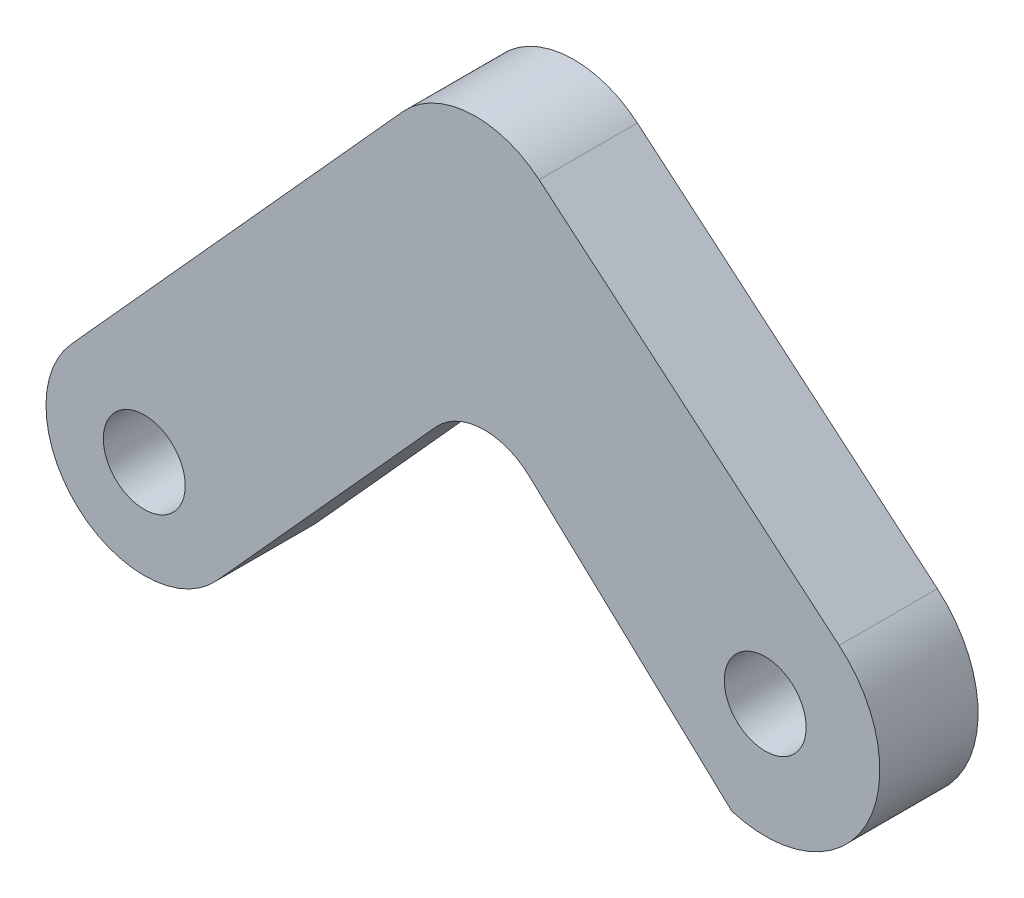
ISO-10303-21;
HEADER;
FILE_DESCRIPTION(('STEP AP214'),'2;1');
FILE_NAME('part.step','',(''),(''),'','','');
FILE_SCHEMA(('AUTOMOTIVE_DESIGN { 1 0 10303 214 1 1 1 1 }'));
ENDSEC;
DATA;
#1=APPLICATION_CONTEXT('core data for automotive mechanical design processes');
#2=APPLICATION_PROTOCOL_DEFINITION('international standard','automotive_design',2000,#1);
#3=PRODUCT_CONTEXT('',#1,'mechanical');
#4=PRODUCT('Part','Part','',(#3));
#5=PRODUCT_RELATED_PRODUCT_CATEGORY('part','',(#4));
#6=PRODUCT_DEFINITION_FORMATION('','',#4);
#7=PRODUCT_DEFINITION_CONTEXT('part definition',#1,'design');
#8=PRODUCT_DEFINITION('design','',#6,#7);
#9=PRODUCT_DEFINITION_SHAPE('','',#8);
#10=(LENGTH_UNIT() NAMED_UNIT(*) SI_UNIT(.MILLI.,.METRE.));
#11=(NAMED_UNIT(*) PLANE_ANGLE_UNIT() SI_UNIT($,.RADIAN.));
#12=(NAMED_UNIT(*) SI_UNIT($,.STERADIAN.) SOLID_ANGLE_UNIT());
#13=UNCERTAINTY_MEASURE_WITH_UNIT(LENGTH_MEASURE(1.E-05),#10,'distance_accuracy_value','');
#14=(GEOMETRIC_REPRESENTATION_CONTEXT(3) GLOBAL_UNCERTAINTY_ASSIGNED_CONTEXT((#13)) GLOBAL_UNIT_ASSIGNED_CONTEXT((#10,
#11,#12)) REPRESENTATION_CONTEXT('',''));
#15=CARTESIAN_POINT('',(0.,0.,0.));
#16=DIRECTION('',(0.,0.,1.));
#17=DIRECTION('',(1.,0.,0.));
#18=AXIS2_PLACEMENT_3D('',#15,#16,#17);
#19=CARTESIAN_POINT('',(8.90555354627744,-8.04307876589465,3.));
#20=DIRECTION('',(0.,0.,1.));
#21=DIRECTION('',(1.,0.,0.));
#22=AXIS2_PLACEMENT_3D('',#19,#20,#21);
#23=PLANE('',#22);
#24=CARTESIAN_POINT('',(8.90555354627744,-8.04307876589465,3.));
#25=DIRECTION('',(0.,0.,1.));
#26=DIRECTION('',(1.,0.,0.));
#27=AXIS2_PLACEMENT_3D('',#24,#25,#26);
#28=CIRCLE('',#27,1.25);
#29=CARTESIAN_POINT('',(10.1555535462774,-8.04307876589465,3.));
#30=VERTEX_POINT('',#29);
#31=EDGE_CURVE('E136',#30,#30,#28,.T.);
#32=ORIENTED_EDGE('',*,*,#31,.F.);
#33=EDGE_LOOP('',(#32));
#34=FACE_BOUND('',#33,.T.);
#35=DIRECTION('',(-0.764131159570834,0.64506090485545,0.));
#36=VECTOR('',#35,1.);
#37=CARTESIAN_POINT('',(-0.215618695095688,4.23715807804301,3.));
#38=LINE('',#37,#36);
#39=CARTESIAN_POINT('',(11.1632667132715,-5.36861970739673,3.));
#40=VERTEX_POINT('',#39);
#41=CARTESIAN_POINT('',(2.00134544875507,2.36565096993392,3.));
#42=VERTEX_POINT('',#41);
#43=EDGE_CURVE('E109',#40,#42,#38,.T.);
#44=ORIENTED_EDGE('',*,*,#43,.T.);
#45=CARTESIAN_POINT('',(0.0661627341887162,0.0732574912214218,3.));
#46=DIRECTION('',(0.,0.,1.));
#47=DIRECTION('',(1.,0.,0.));
#48=AXIS2_PLACEMENT_3D('',#45,#46,#47);
#49=CIRCLE('',#48,3.);
#50=CARTESIAN_POINT('',(-2.16022565238064,2.08402718269509,3.));
#51=VERTEX_POINT('',#50);
#52=EDGE_CURVE('E105',#42,#51,#49,.T.);
#53=ORIENTED_EDGE('',*,*,#52,.T.);
#54=DIRECTION('',(-0.670256563824557,-0.742129462189784,0.));
#55=VECTOR('',#54,1.);
#56=CARTESIAN_POINT('',(-0.215618695095688,4.23715807804301,3.));
#57=LINE('',#56,#55);
#58=CARTESIAN_POINT('',(-12.2802368439377,-9.12117224137309,3.));
#59=VERTEX_POINT('',#58);
#60=EDGE_CURVE('E97',#51,#59,#57,.T.);
#61=ORIENTED_EDGE('',*,*,#60,.T.);
#62=CARTESIAN_POINT('',(-10.0538484573684,-11.1319419328468,3.));
#63=DIRECTION('',(0.,0.,1.));
#64=DIRECTION('',(1.,0.,0.));
#65=AXIS2_PLACEMENT_3D('',#62,#63,#64);
#66=CIRCLE('',#65,3.);
#67=CARTESIAN_POINT('',(-7.827460070799,-13.1427116243204,3.));
#68=VERTEX_POINT('',#67);
#69=EDGE_CURVE('E102',#59,#68,#66,.T.);
#70=ORIENTED_EDGE('',*,*,#69,.T.);
#71=DIRECTION('',(0.670256563824557,0.742129462189784,0.));
#72=VECTOR('',#71,1.);
#73=CARTESIAN_POINT('',(0.215618695095688,-4.23715807804301,3.));
#74=LINE('',#73,#72);
#75=CARTESIAN_POINT('',(-1.14658156815648,-5.74542969121998,3.));
#76=VERTEX_POINT('',#75);
#77=EDGE_CURVE('E123',#68,#76,#74,.T.);
#78=ORIENTED_EDGE('',*,*,#77,.T.);
#79=CARTESIAN_POINT('',(0.337677356223085,-7.0859428188691,3.));
#80=DIRECTION('',(0.,0.,1.));
#81=DIRECTION('',(1.,0.,0.));
#82=AXIS2_PLACEMENT_3D('',#79,#80,#81);
#83=CIRCLE('',#82,2.);
#84=CARTESIAN_POINT('',(1.70183634163487,-5.62338674728747,3.));
#85=VERTEX_POINT('',#84);
#86=EDGE_CURVE('E11',#76,#85,#83,.F.);
#87=ORIENTED_EDGE('',*,*,#86,.T.);
#88=DIRECTION('',(0.731278035790812,-0.682079492705895,0.));
#89=VECTOR('',#88,1.);
#90=CARTESIAN_POINT('',(0.215618695095688,-4.23715807804301,3.));
#91=LINE('',#90,#89);
#92=CARTESIAN_POINT('',(7.88567103741643,-11.391188630896,3.));
#93=VERTEX_POINT('',#92);
#94=EDGE_CURVE('E125',#85,#93,#91,.T.);
#95=ORIENTED_EDGE('',*,*,#94,.T.);
#96=CARTESIAN_POINT('',(8.90555354627744,-8.04307876589465,3.));
#97=DIRECTION('',(0.,0.,1.));
#98=DIRECTION('',(1.,0.,0.));
#99=AXIS2_PLACEMENT_3D('',#96,#97,#98);
#100=CIRCLE('',#99,3.5);
#101=EDGE_CURVE('E130',#93,#40,#100,.T.);
#102=ORIENTED_EDGE('',*,*,#101,.T.);
#103=EDGE_LOOP('',(#44,#53,#61,#70,#78,#87,#95,#102));
#104=FACE_BOUND('',#103,.T.);
#105=CARTESIAN_POINT('',(-10.0538484573684,-11.1319419328468,3.));
#106=DIRECTION('',(0.,0.,1.));
#107=DIRECTION('',(1.,0.,0.));
#108=AXIS2_PLACEMENT_3D('',#105,#106,#107);
#109=CIRCLE('',#108,1.25);
#110=CARTESIAN_POINT('',(-8.80384845736835,-11.1319419328468,3.));
#111=VERTEX_POINT('',#110);
#112=EDGE_CURVE('E184',#111,#111,#109,.T.);
#113=ORIENTED_EDGE('',*,*,#112,.F.);
#114=EDGE_LOOP('',(#113));
#115=FACE_BOUND('',#114,.T.);
#116=ADVANCED_FACE('F33',(#34,#104,#115),#23,.T.);
#117=CARTESIAN_POINT('',(8.90555354627744,-8.04307876589465,0.));
#118=DIRECTION('',(0.,0.,1.));
#119=DIRECTION('',(1.,0.,0.));
#120=AXIS2_PLACEMENT_3D('',#117,#118,#119);
#121=PLANE('',#120);
#122=CARTESIAN_POINT('',(8.90555354627744,-8.04307876589465,0.));
#123=DIRECTION('',(0.,0.,1.));
#124=DIRECTION('',(1.,0.,0.));
#125=AXIS2_PLACEMENT_3D('',#122,#123,#124);
#126=CIRCLE('',#125,1.25);
#127=CARTESIAN_POINT('',(10.1555535462774,-8.04307876589465,0.));
#128=VERTEX_POINT('',#127);
#129=EDGE_CURVE('E181',#128,#128,#126,.T.);
#130=ORIENTED_EDGE('',*,*,#129,.T.);
#131=EDGE_LOOP('',(#130));
#132=FACE_BOUND('',#131,.T.);
#133=DIRECTION('',(-0.670256563824557,-0.742129462189784,0.));
#134=VECTOR('',#133,1.);
#135=CARTESIAN_POINT('',(-0.215618695095688,4.23715807804301,0.));
#136=LINE('',#135,#134);
#137=CARTESIAN_POINT('',(-2.16022565238064,2.08402718269509,0.));
#138=VERTEX_POINT('',#137);
#139=CARTESIAN_POINT('',(-12.2802368439377,-9.12117224137309,0.));
#140=VERTEX_POINT('',#139);
#141=EDGE_CURVE('E115',#138,#140,#136,.T.);
#142=ORIENTED_EDGE('',*,*,#141,.F.);
#143=CARTESIAN_POINT('',(0.0661627341887162,0.0732574912214218,0.));
#144=DIRECTION('',(0.,0.,1.));
#145=DIRECTION('',(1.,0.,0.));
#146=AXIS2_PLACEMENT_3D('',#143,#144,#145);
#147=CIRCLE('',#146,3.);
#148=CARTESIAN_POINT('',(2.00134544875507,2.36565096993392,0.));
#149=VERTEX_POINT('',#148);
#150=EDGE_CURVE('E153',#138,#149,#147,.F.);
#151=ORIENTED_EDGE('',*,*,#150,.T.);
#152=DIRECTION('',(-0.764131159570834,0.64506090485545,0.));
#153=VECTOR('',#152,1.);
#154=CARTESIAN_POINT('',(-0.215618695095688,4.23715807804301,0.));
#155=LINE('',#154,#153);
#156=CARTESIAN_POINT('',(11.1632667132715,-5.36861970739673,0.));
#157=VERTEX_POINT('',#156);
#158=EDGE_CURVE('E133',#157,#149,#155,.T.);
#159=ORIENTED_EDGE('',*,*,#158,.F.);
#160=CARTESIAN_POINT('',(8.90555354627744,-8.04307876589465,0.));
#161=DIRECTION('',(0.,0.,1.));
#162=DIRECTION('',(1.,0.,0.));
#163=AXIS2_PLACEMENT_3D('',#160,#161,#162);
#164=CIRCLE('',#163,3.5);
#165=CARTESIAN_POINT('',(7.88567103741643,-11.391188630896,0.));
#166=VERTEX_POINT('',#165);
#167=EDGE_CURVE('E144',#166,#157,#164,.T.);
#168=ORIENTED_EDGE('',*,*,#167,.F.);
#169=DIRECTION('',(0.731278035790812,-0.682079492705895,0.));
#170=VECTOR('',#169,1.);
#171=CARTESIAN_POINT('',(0.215618695095688,-4.23715807804301,0.));
#172=LINE('',#171,#170);
#173=CARTESIAN_POINT('',(1.70183634163487,-5.62338674728747,0.));
#174=VERTEX_POINT('',#173);
#175=EDGE_CURVE('E142',#174,#166,#172,.T.);
#176=ORIENTED_EDGE('',*,*,#175,.F.);
#177=CARTESIAN_POINT('',(0.337677356223085,-7.0859428188691,0.));
#178=DIRECTION('',(0.,0.,1.));
#179=DIRECTION('',(1.,0.,0.));
#180=AXIS2_PLACEMENT_3D('',#177,#178,#179);
#181=CIRCLE('',#180,2.);
#182=CARTESIAN_POINT('',(-1.14658156815648,-5.74542969121998,0.));
#183=VERTEX_POINT('',#182);
#184=EDGE_CURVE('E41',#174,#183,#181,.T.);
#185=ORIENTED_EDGE('',*,*,#184,.T.);
#186=DIRECTION('',(0.670256563824557,0.742129462189784,0.));
#187=VECTOR('',#186,1.);
#188=CARTESIAN_POINT('',(0.215618695095688,-4.23715807804301,0.));
#189=LINE('',#188,#187);
#190=CARTESIAN_POINT('',(-7.827460070799,-13.1427116243204,0.));
#191=VERTEX_POINT('',#190);
#192=EDGE_CURVE('E140',#191,#183,#189,.T.);
#193=ORIENTED_EDGE('',*,*,#192,.F.);
#194=CARTESIAN_POINT('',(-10.0538484573684,-11.1319419328468,0.));
#195=DIRECTION('',(0.,0.,1.));
#196=DIRECTION('',(1.,0.,0.));
#197=AXIS2_PLACEMENT_3D('',#194,#195,#196);
#198=CIRCLE('',#197,3.);
#199=EDGE_CURVE('E138',#140,#191,#198,.T.);
#200=ORIENTED_EDGE('',*,*,#199,.F.);
#201=EDGE_LOOP('',(#142,#151,#159,#168,#176,#185,#193,#200));
#202=FACE_BOUND('',#201,.T.);
#203=CARTESIAN_POINT('',(-10.0538484573684,-11.1319419328468,0.));
#204=DIRECTION('',(0.,0.,1.));
#205=DIRECTION('',(1.,0.,0.));
#206=AXIS2_PLACEMENT_3D('',#203,#204,#205);
#207=CIRCLE('',#206,1.25);
#208=CARTESIAN_POINT('',(-8.80384845736835,-11.1319419328468,0.));
#209=VERTEX_POINT('',#208);
#210=EDGE_CURVE('E187',#209,#209,#207,.T.);
#211=ORIENTED_EDGE('',*,*,#210,.T.);
#212=EDGE_LOOP('',(#211));
#213=FACE_BOUND('',#212,.T.);
#214=ADVANCED_FACE('F169',(#132,#202,#213),#121,.F.);
#215=CARTESIAN_POINT('',(-0.215618695095688,4.23715807804301,3.));
#216=DIRECTION('',(-0.645060904855451,-0.764131159570834,0.));
#217=DIRECTION('',(0.764131159570834,-0.645060904855451,0.));
#218=AXIS2_PLACEMENT_3D('',#215,#216,#217);
#219=PLANE('',#218);
#220=ORIENTED_EDGE('',*,*,#158,.T.);
#221=DIRECTION('',(0.,0.,-1.));
#222=VECTOR('',#221,1.);
#223=CARTESIAN_POINT('',(2.00134544875507,2.36565096993392,3.));
#224=LINE('',#223,#222);
#225=EDGE_CURVE('E155',#149,#42,#224,.F.);
#226=ORIENTED_EDGE('',*,*,#225,.T.);
#227=ORIENTED_EDGE('',*,*,#43,.F.);
#228=DIRECTION('',(0.,0.,-1.));
#229=VECTOR('',#228,1.);
#230=CARTESIAN_POINT('',(11.1632667132715,-5.36861970739673,3.));
#231=LINE('',#230,#229);
#232=EDGE_CURVE('E132',#40,#157,#231,.T.);
#233=ORIENTED_EDGE('',*,*,#232,.T.);
#234=EDGE_LOOP('',(#220,#226,#227,#233));
#235=FACE_BOUND('',#234,.T.);
#236=ADVANCED_FACE('F178',(#235),#219,.F.);
#237=CARTESIAN_POINT('',(-0.215618695095688,4.23715807804301,3.));
#238=DIRECTION('',(0.742129462189784,-0.670256563824557,0.));
#239=DIRECTION('',(0.670256563824557,0.742129462189784,0.));
#240=AXIS2_PLACEMENT_3D('',#237,#238,#239);
#241=PLANE('',#240);
#242=ORIENTED_EDGE('',*,*,#60,.F.);
#243=DIRECTION('',(0.,0.,-1.));
#244=VECTOR('',#243,1.);
#245=CARTESIAN_POINT('',(-2.16022565238064,2.08402718269509,3.));
#246=LINE('',#245,#244);
#247=EDGE_CURVE('E118',#51,#138,#246,.T.);
#248=ORIENTED_EDGE('',*,*,#247,.T.);
#249=ORIENTED_EDGE('',*,*,#141,.T.);
#250=DIRECTION('',(0.,0.,-1.));
#251=VECTOR('',#250,1.);
#252=CARTESIAN_POINT('',(-12.2802368439377,-9.12117224137309,3.));
#253=LINE('',#252,#251);
#254=EDGE_CURVE('E112',#59,#140,#253,.T.);
#255=ORIENTED_EDGE('',*,*,#254,.F.);
#256=EDGE_LOOP('',(#242,#248,#249,#255));
#257=FACE_BOUND('',#256,.T.);
#258=ADVANCED_FACE('F113',(#257),#241,.F.);
#259=CARTESIAN_POINT('',(-10.0538484573684,-11.1319419328468,3.));
#260=DIRECTION('',(0.,0.,-1.));
#261=DIRECTION('',(-1.,0.,0.));
#262=AXIS2_PLACEMENT_3D('',#259,#260,#261);
#263=CYLINDRICAL_SURFACE('',#262,3.);
#264=ORIENTED_EDGE('',*,*,#199,.T.);
#265=DIRECTION('',(0.,0.,-1.));
#266=VECTOR('',#265,1.);
#267=CARTESIAN_POINT('',(-7.827460070799,-13.1427116243204,3.));
#268=LINE('',#267,#266);
#269=EDGE_CURVE('E119',#68,#191,#268,.T.);
#270=ORIENTED_EDGE('',*,*,#269,.F.);
#271=ORIENTED_EDGE('',*,*,#69,.F.);
#272=ORIENTED_EDGE('',*,*,#254,.T.);
#273=EDGE_LOOP('',(#264,#270,#271,#272));
#274=FACE_BOUND('',#273,.T.);
#275=ADVANCED_FACE('F121',(#274),#263,.T.);
#276=CARTESIAN_POINT('',(0.215618695095688,-4.23715807804301,3.));
#277=DIRECTION('',(-0.742129462189784,0.670256563824557,0.));
#278=DIRECTION('',(-0.670256563824557,-0.742129462189784,0.));
#279=AXIS2_PLACEMENT_3D('',#276,#277,#278);
#280=PLANE('',#279);
#281=ORIENTED_EDGE('',*,*,#192,.T.);
#282=DIRECTION('',(0.,0.,-1.));
#283=VECTOR('',#282,1.);
#284=CARTESIAN_POINT('',(-1.14658156815648,-5.74542969121998,3.));
#285=LINE('',#284,#283);
#286=EDGE_CURVE('E48',#183,#76,#285,.F.);
#287=ORIENTED_EDGE('',*,*,#286,.T.);
#288=ORIENTED_EDGE('',*,*,#77,.F.);
#289=ORIENTED_EDGE('',*,*,#269,.T.);
#290=EDGE_LOOP('',(#281,#287,#288,#289));
#291=FACE_BOUND('',#290,.T.);
#292=ADVANCED_FACE('F212',(#291),#280,.F.);
#293=CARTESIAN_POINT('',(0.215618695095688,-4.23715807804301,3.));
#294=DIRECTION('',(0.682079492705895,0.731278035790813,0.));
#295=DIRECTION('',(-0.731278035790813,0.682079492705895,0.));
#296=AXIS2_PLACEMENT_3D('',#293,#294,#295);
#297=PLANE('',#296);
#298=ORIENTED_EDGE('',*,*,#94,.F.);
#299=DIRECTION('',(0.,0.,-1.));
#300=VECTOR('',#299,1.);
#301=CARTESIAN_POINT('',(1.70183634163488,-5.62338674728747,0.));
#302=LINE('',#301,#300);
#303=EDGE_CURVE('E158',#85,#174,#302,.T.);
#304=ORIENTED_EDGE('',*,*,#303,.T.);
#305=ORIENTED_EDGE('',*,*,#175,.T.);
#306=DIRECTION('',(0.,0.,-1.));
#307=VECTOR('',#306,1.);
#308=CARTESIAN_POINT('',(7.88567103741643,-11.391188630896,3.));
#309=LINE('',#308,#307);
#310=EDGE_CURVE('E148',#93,#166,#309,.T.);
#311=ORIENTED_EDGE('',*,*,#310,.F.);
#312=EDGE_LOOP('',(#298,#304,#305,#311));
#313=FACE_BOUND('',#312,.T.);
#314=ADVANCED_FACE('F164',(#313),#297,.F.);
#315=CARTESIAN_POINT('',(8.90555354627744,-8.04307876589465,3.));
#316=DIRECTION('',(0.,0.,-1.));
#317=DIRECTION('',(-1.,0.,0.));
#318=AXIS2_PLACEMENT_3D('',#315,#316,#317);
#319=CYLINDRICAL_SURFACE('',#318,3.5);
#320=ORIENTED_EDGE('',*,*,#167,.T.);
#321=ORIENTED_EDGE('',*,*,#232,.F.);
#322=ORIENTED_EDGE('',*,*,#101,.F.);
#323=ORIENTED_EDGE('',*,*,#310,.T.);
#324=EDGE_LOOP('',(#320,#321,#322,#323));
#325=FACE_BOUND('',#324,.T.);
#326=ADVANCED_FACE('F174',(#325),#319,.T.);
#327=CARTESIAN_POINT('',(8.90555354627744,-8.04307876589465,3.));
#328=DIRECTION('',(0.,0.,-1.));
#329=DIRECTION('',(-1.,0.,0.));
#330=AXIS2_PLACEMENT_3D('',#327,#328,#329);
#331=CYLINDRICAL_SURFACE('',#330,1.25);
#332=ORIENTED_EDGE('',*,*,#31,.T.);
#333=EDGE_LOOP('',(#332));
#334=FACE_BOUND('',#333,.T.);
#335=ORIENTED_EDGE('',*,*,#129,.F.);
#336=EDGE_LOOP('',(#335));
#337=FACE_BOUND('',#336,.T.);
#338=ADVANCED_FACE('F205',(#334,#337),#331,.F.);
#339=CARTESIAN_POINT('',(-10.0538484573684,-11.1319419328468,3.));
#340=DIRECTION('',(0.,0.,-1.));
#341=DIRECTION('',(-1.,0.,0.));
#342=AXIS2_PLACEMENT_3D('',#339,#340,#341);
#343=CYLINDRICAL_SURFACE('',#342,1.25);
#344=ORIENTED_EDGE('',*,*,#112,.T.);
#345=EDGE_LOOP('',(#344));
#346=FACE_BOUND('',#345,.T.);
#347=ORIENTED_EDGE('',*,*,#210,.F.);
#348=EDGE_LOOP('',(#347));
#349=FACE_BOUND('',#348,.T.);
#350=ADVANCED_FACE('F193',(#346,#349),#343,.F.);
#351=CARTESIAN_POINT('',(0.0661627341887162,0.0732574912214218,3.));
#352=DIRECTION('',(0.,0.,-1.));
#353=DIRECTION('',(-1.,0.,0.));
#354=AXIS2_PLACEMENT_3D('',#351,#352,#353);
#355=CYLINDRICAL_SURFACE('',#354,3.);
#356=ORIENTED_EDGE('',*,*,#52,.F.);
#357=ORIENTED_EDGE('',*,*,#225,.F.);
#358=ORIENTED_EDGE('',*,*,#150,.F.);
#359=ORIENTED_EDGE('',*,*,#247,.F.);
#360=EDGE_LOOP('',(#356,#357,#358,#359));
#361=FACE_BOUND('',#360,.T.);
#362=ADVANCED_FACE('F220',(#361),#355,.T.);
#363=CARTESIAN_POINT('',(0.337677356223085,-7.0859428188691,3.));
#364=DIRECTION('',(0.,0.,1.));
#365=DIRECTION('',(1.,0.,0.));
#366=AXIS2_PLACEMENT_3D('',#363,#364,#365);
#367=CYLINDRICAL_SURFACE('',#366,2.);
#368=ORIENTED_EDGE('',*,*,#86,.F.);
#369=ORIENTED_EDGE('',*,*,#286,.F.);
#370=ORIENTED_EDGE('',*,*,#184,.F.);
#371=ORIENTED_EDGE('',*,*,#303,.F.);
#372=EDGE_LOOP('',(#368,#369,#370,#371));
#373=FACE_BOUND('',#372,.T.);
#374=ADVANCED_FACE('F35',(#373),#367,.F.);
#375=CLOSED_SHELL('',(#116,#214,#236,#258,#275,#292,#314,#326,#338,#350,#362,#374));
#376=MANIFOLD_SOLID_BREP('B2',#375);
#377=ADVANCED_BREP_SHAPE_REPRESENTATION('',(#18,#376),#14);
#378=SHAPE_DEFINITION_REPRESENTATION(#9,#377);
ENDSEC;
END-ISO-10303-21;
